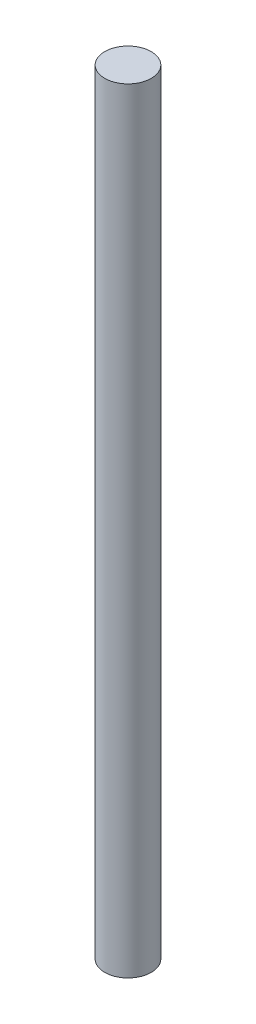
ISO-10303-21;
HEADER;
FILE_DESCRIPTION(('STEP AP214'),'2;1');
FILE_NAME('part.step','',(''),(''),'','','');
FILE_SCHEMA(('AUTOMOTIVE_DESIGN { 1 0 10303 214 1 1 1 1 }'));
ENDSEC;
DATA;
#1=APPLICATION_CONTEXT('core data for automotive mechanical design processes');
#2=APPLICATION_PROTOCOL_DEFINITION('international standard','automotive_design',2000,#1);
#3=PRODUCT_CONTEXT('',#1,'mechanical');
#4=PRODUCT('Part','Part','',(#3));
#5=PRODUCT_RELATED_PRODUCT_CATEGORY('part','',(#4));
#6=PRODUCT_DEFINITION_FORMATION('','',#4);
#7=PRODUCT_DEFINITION_CONTEXT('part definition',#1,'design');
#8=PRODUCT_DEFINITION('design','',#6,#7);
#9=PRODUCT_DEFINITION_SHAPE('','',#8);
#10=(LENGTH_UNIT() NAMED_UNIT(*) SI_UNIT(.MILLI.,.METRE.));
#11=(NAMED_UNIT(*) PLANE_ANGLE_UNIT() SI_UNIT($,.RADIAN.));
#12=(NAMED_UNIT(*) SI_UNIT($,.STERADIAN.) SOLID_ANGLE_UNIT());
#13=UNCERTAINTY_MEASURE_WITH_UNIT(LENGTH_MEASURE(1.E-05),#10,'distance_accuracy_value','');
#14=(GEOMETRIC_REPRESENTATION_CONTEXT(3) GLOBAL_UNCERTAINTY_ASSIGNED_CONTEXT((#13)) GLOBAL_UNIT_ASSIGNED_CONTEXT((#10,
#11,#12)) REPRESENTATION_CONTEXT('',''));
#15=CARTESIAN_POINT('',(0.,0.,0.));
#16=DIRECTION('',(0.,0.,1.));
#17=DIRECTION('',(1.,0.,0.));
#18=AXIS2_PLACEMENT_3D('',#15,#16,#17);
#19=CARTESIAN_POINT('',(0.,10.,0.));
#20=DIRECTION('',(0.,-1.,0.));
#21=DIRECTION('',(0.,0.,-1.));
#22=AXIS2_PLACEMENT_3D('',#19,#20,#21);
#23=CYLINDRICAL_SURFACE('',#22,0.3);
#24=CARTESIAN_POINT('',(0.,10.,0.));
#25=DIRECTION('',(0.,1.,0.));
#26=DIRECTION('',(0.,0.,1.));
#27=AXIS2_PLACEMENT_3D('',#24,#25,#26);
#28=CIRCLE('',#27,0.3);
#29=CARTESIAN_POINT('',(0.,10.,0.3));
#30=VERTEX_POINT('',#29);
#31=EDGE_CURVE('E10',#30,#30,#28,.T.);
#32=ORIENTED_EDGE('',*,*,#31,.F.);
#33=EDGE_LOOP('',(#32));
#34=FACE_BOUND('',#33,.T.);
#35=CARTESIAN_POINT('',(0.,0.,0.));
#36=DIRECTION('',(0.,1.,0.));
#37=DIRECTION('',(0.,0.,1.));
#38=AXIS2_PLACEMENT_3D('',#35,#36,#37);
#39=CIRCLE('',#38,0.3);
#40=CARTESIAN_POINT('',(0.,0.,0.3));
#41=VERTEX_POINT('',#40);
#42=EDGE_CURVE('E31',#41,#41,#39,.T.);
#43=ORIENTED_EDGE('',*,*,#42,.T.);
#44=EDGE_LOOP('',(#43));
#45=FACE_BOUND('',#44,.T.);
#46=ADVANCED_FACE('F28',(#34,#45),#23,.T.);
#47=CARTESIAN_POINT('',(0.,10.,0.));
#48=DIRECTION('',(0.,1.,0.));
#49=DIRECTION('',(0.,0.,1.));
#50=AXIS2_PLACEMENT_3D('',#47,#48,#49);
#51=PLANE('',#50);
#52=ORIENTED_EDGE('',*,*,#31,.T.);
#53=EDGE_LOOP('',(#52));
#54=FACE_BOUND('',#53,.T.);
#55=ADVANCED_FACE('F43',(#54),#51,.T.);
#56=CARTESIAN_POINT('',(0.,0.,0.));
#57=DIRECTION('',(0.,1.,0.));
#58=DIRECTION('',(0.,0.,1.));
#59=AXIS2_PLACEMENT_3D('',#56,#57,#58);
#60=PLANE('',#59);
#61=ORIENTED_EDGE('',*,*,#42,.F.);
#62=EDGE_LOOP('',(#61));
#63=FACE_BOUND('',#62,.T.);
#64=ADVANCED_FACE('F41',(#63),#60,.F.);
#65=CLOSED_SHELL('',(#46,#55,#64));
#66=MANIFOLD_SOLID_BREP('B2',#65);
#67=ADVANCED_BREP_SHAPE_REPRESENTATION('',(#18,#66),#14);
#68=SHAPE_DEFINITION_REPRESENTATION(#9,#67);
ENDSEC;
END-ISO-10303-21;
